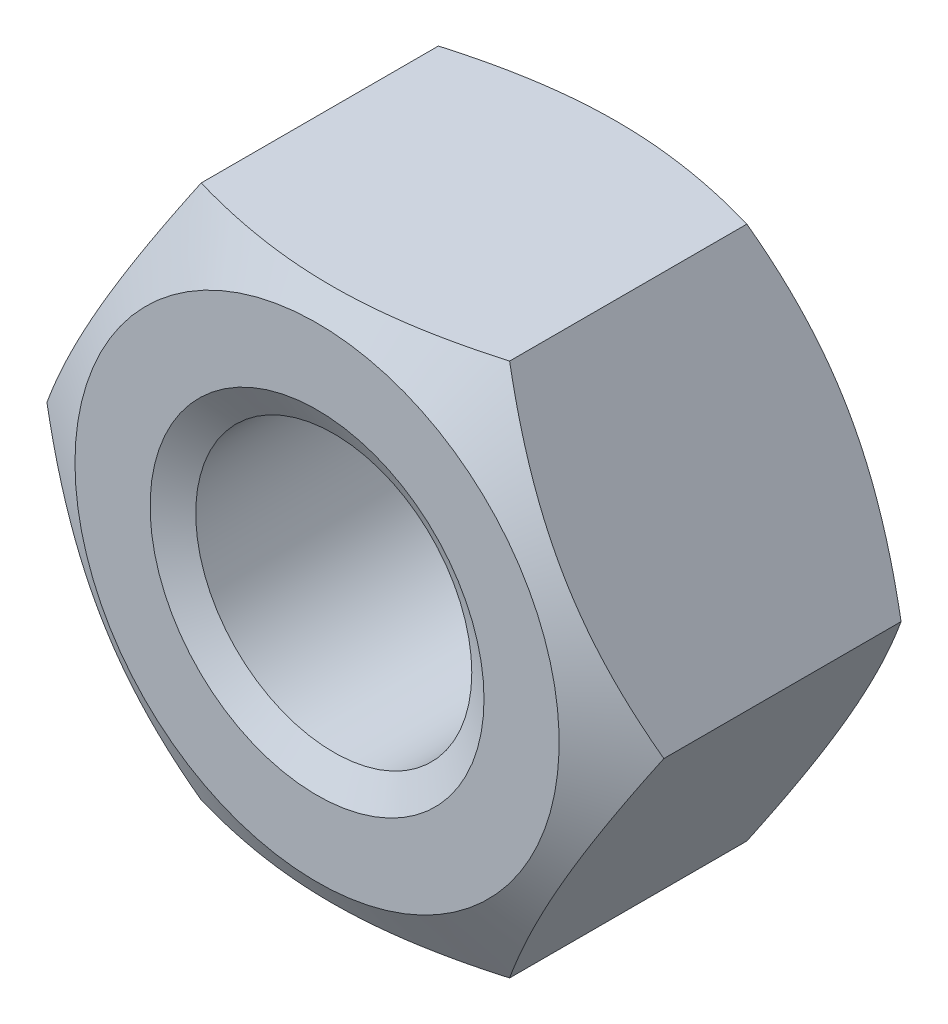
ISO-10303-21;
HEADER;
FILE_DESCRIPTION(('STEP AP214'),'2;1');
FILE_NAME('part.step','',(''),(''),'','','');
FILE_SCHEMA(('AUTOMOTIVE_DESIGN { 1 0 10303 214 1 1 1 1 }'));
ENDSEC;
DATA;
#1=APPLICATION_CONTEXT('core data for automotive mechanical design processes');
#2=APPLICATION_PROTOCOL_DEFINITION('international standard','automotive_design',2000,#1);
#3=PRODUCT_CONTEXT('',#1,'mechanical');
#4=PRODUCT('Part','Part','',(#3));
#5=PRODUCT_RELATED_PRODUCT_CATEGORY('part','',(#4));
#6=PRODUCT_DEFINITION_FORMATION('','',#4);
#7=PRODUCT_DEFINITION_CONTEXT('part definition',#1,'design');
#8=PRODUCT_DEFINITION('design','',#6,#7);
#9=PRODUCT_DEFINITION_SHAPE('','',#8);
#10=(LENGTH_UNIT() NAMED_UNIT(*) SI_UNIT(.MILLI.,.METRE.));
#11=(NAMED_UNIT(*) PLANE_ANGLE_UNIT() SI_UNIT($,.RADIAN.));
#12=(NAMED_UNIT(*) SI_UNIT($,.STERADIAN.) SOLID_ANGLE_UNIT());
#13=UNCERTAINTY_MEASURE_WITH_UNIT(LENGTH_MEASURE(1.E-05),#10,'distance_accuracy_value','');
#14=(GEOMETRIC_REPRESENTATION_CONTEXT(3) GLOBAL_UNCERTAINTY_ASSIGNED_CONTEXT((#13)) GLOBAL_UNIT_ASSIGNED_CONTEXT((#10,
#11,#12)) REPRESENTATION_CONTEXT('',''));
#15=CARTESIAN_POINT('',(0.,0.,0.));
#16=DIRECTION('',(0.,0.,1.));
#17=DIRECTION('',(1.,0.,0.));
#18=AXIS2_PLACEMENT_3D('',#15,#16,#17);
#19=CARTESIAN_POINT('',(2.3094010767585,-4.,-4.7));
#20=DIRECTION('',(0.866025403784439,-0.5,0.));
#21=DIRECTION('',(0.5,0.866025403784439,0.));
#22=AXIS2_PLACEMENT_3D('',#19,#20,#21);
#23=PLANE('',#22);
#24=CARTESIAN_POINT('',(2.30928560670467,-4.0002,-0.573838610020871));
#25=CARTESIAN_POINT('',(2.4107717464617,-3.82442084967677,-0.515224224594387));
#26=CARTESIAN_POINT('',(2.51313390883499,-3.64712438367362,-0.461916672408368));
#27=CARTESIAN_POINT('',(2.71963072479811,-3.28946140682429,-0.368868021692509));
#28=CARTESIAN_POINT('',(2.82376904741904,-3.10908854102985,-0.329159839975811));
#29=CARTESIAN_POINT('',(3.03075510011795,-2.75057818129721,-0.267348566226386));
#30=CARTESIAN_POINT('',(3.13357098372492,-2.57249584706486,-0.244834082468996));
#31=CARTESIAN_POINT('',(3.33968651028528,-2.21549328283349,-0.217956974092689));
#32=CARTESIAN_POINT('',(3.44298540411434,-2.0365743503559,-0.213572092373051));
#33=CARTESIAN_POINT('',(3.63600352522932,-1.70225715780327,-0.222696423886077));
#34=CARTESIAN_POINT('',(3.72575165335064,-1.54680884001294,-0.233965304934101));
#35=CARTESIAN_POINT('',(3.90466320392054,-1.23692494436495,-0.269680341744299));
#36=CARTESIAN_POINT('',(3.99382600759478,-1.08249043825587,-0.29413869665764));
#37=CARTESIAN_POINT('',(4.17310641015197,-0.771967672225423,-0.355282415865395));
#38=CARTESIAN_POINT('',(4.26320131938131,-0.615918711936898,-0.392226954600969));
#39=CARTESIAN_POINT('',(4.4420474282755,-0.306148164596161,-0.476076423494131));
#40=CARTESIAN_POINT('',(4.53080091904966,-0.152422609226221,-0.522961653158844));
#41=CARTESIAN_POINT('',(4.61891762357084,0.000199999999999867,-0.573838610020871));
#42=B_SPLINE_CURVE_WITH_KNOTS('',3,(#24,#25,#26,#27,#28,#29,#30,#31,#32,#33,#34,#35,#36,#37,#38,
#39,#40,#41),.UNSPECIFIED.,.F.,.F.,(4,2,2,2,2,2,2,2,4),(0.,0.634047835695965,1.26961969224543,
1.88946157213122,2.50854226669297,3.04757825393385,3.58711366126903,4.13861653143764,
4.68903648037743),.UNSPECIFIED.);
#43=CARTESIAN_POINT('',(2.30940107675851,-4.,-0.573771940854268));
#44=VERTEX_POINT('',#43);
#45=CARTESIAN_POINT('',(4.61880215351701,0.,-0.573771940854268));
#46=VERTEX_POINT('',#45);
#47=EDGE_CURVE('E50',#44,#46,#42,.T.);
#48=ORIENTED_EDGE('',*,*,#47,.F.);
#49=DIRECTION('',(0.,0.,1.));
#50=VECTOR('',#49,1.);
#51=CARTESIAN_POINT('',(2.3094010767585,-4.,-4.7));
#52=LINE('',#51,#50);
#53=CARTESIAN_POINT('',(2.30940107675851,-4.,-4.12622805914573));
#54=VERTEX_POINT('',#53);
#55=EDGE_CURVE('E114',#54,#44,#52,.T.);
#56=ORIENTED_EDGE('',*,*,#55,.F.);
#57=CARTESIAN_POINT('',(4.61891762357084,0.000200000000000424,-4.12616138997913));
#58=CARTESIAN_POINT('',(4.5174314838138,-0.175579150323227,-4.18477577540561));
#59=CARTESIAN_POINT('',(4.41506932144052,-0.35287561632638,-4.23808332759163));
#60=CARTESIAN_POINT('',(4.2085725054774,-0.710538593175705,-4.33113197830749));
#61=CARTESIAN_POINT('',(4.10443418285647,-0.89091145897015,-4.37084016002419));
#62=CARTESIAN_POINT('',(3.89744813015756,-1.24942181870279,-4.43265143377362));
#63=CARTESIAN_POINT('',(3.79463224655059,-1.42750415293514,-4.455165917531));
#64=CARTESIAN_POINT('',(3.58851671999023,-1.78450671716651,-4.48204302590731));
#65=CARTESIAN_POINT('',(3.48521782616117,-1.9634256496441,-4.48642790762695));
#66=CARTESIAN_POINT('',(3.29219970504619,-2.29774284219673,-4.47730357611392));
#67=CARTESIAN_POINT('',(3.20245157692486,-2.45319115998706,-4.4660346950659));
#68=CARTESIAN_POINT('',(3.02354002635497,-2.76307505563505,-4.4303196582557));
#69=CARTESIAN_POINT('',(2.93437722268073,-2.91750956174413,-4.40586130334236));
#70=CARTESIAN_POINT('',(2.75509682012354,-3.22803232777458,-4.34471758413461));
#71=CARTESIAN_POINT('',(2.6650019108942,-3.3840812880631,-4.30777304539903));
#72=CARTESIAN_POINT('',(2.48615580200001,-3.69385183540384,-4.22392357650587));
#73=CARTESIAN_POINT('',(2.39740231122585,-3.84757739077378,-4.17703834684116));
#74=CARTESIAN_POINT('',(2.30928560670467,-4.0002,-4.12616138997913));
#75=B_SPLINE_CURVE_WITH_KNOTS('',3,(#57,#58,#59,#60,#61,#62,#63,#64,#65,#66,#67,#68,#69,#70,#71,
#72,#73,#74),.UNSPECIFIED.,.F.,.F.,(4,2,2,2,2,2,2,2,4),(0.,0.634047835695965,1.26961969224543,
1.88946157213122,2.50854226669297,3.04757825393385,3.58711366126903,4.13861653143764,
4.68903648037743),.UNSPECIFIED.);
#76=CARTESIAN_POINT('',(4.61880215351701,0.,-4.12622805914573));
#77=VERTEX_POINT('',#76);
#78=EDGE_CURVE('E125',#77,#54,#75,.T.);
#79=ORIENTED_EDGE('',*,*,#78,.F.);
#80=DIRECTION('',(0.,0.,1.));
#81=VECTOR('',#80,1.);
#82=CARTESIAN_POINT('',(4.61880215351701,0.,-4.7));
#83=LINE('',#82,#81);
#84=EDGE_CURVE('E122',#77,#46,#83,.T.);
#85=ORIENTED_EDGE('',*,*,#84,.T.);
#86=EDGE_LOOP('',(#48,#56,#79,#85));
#87=FACE_BOUND('',#86,.T.);
#88=ADVANCED_FACE('F35',(#87),#23,.T.);
#89=CARTESIAN_POINT('',(-2.3094010767585,-4.,-4.7));
#90=DIRECTION('',(0.,-1.,0.));
#91=DIRECTION('',(1.,0.,0.));
#92=AXIS2_PLACEMENT_3D('',#89,#90,#91);
#93=PLANE('',#92);
#94=CARTESIAN_POINT('',(-6.09489331699833,-4.,-2.11613226173038));
#95=CARTESIAN_POINT('',(-5.91950199158532,-4.,-2.03149845459807));
#96=CARTESIAN_POINT('',(-5.7436925721675,-4.,-1.94771521780684));
#97=CARTESIAN_POINT('',(-5.39101133396244,-4.,-1.78233664211584));
#98=CARTESIAN_POINT('',(-5.21413933442482,-4.,-1.70074168913957));
#99=CARTESIAN_POINT('',(-4.85813636501619,-4.,-1.53979001519612));
#100=CARTESIAN_POINT('',(-4.67899824047163,-4.,-1.46044906154063));
#101=CARTESIAN_POINT('',(-4.31923849988964,-4.,-1.30521851480991));
#102=CARTESIAN_POINT('',(-4.13861696283161,-4.,-1.22932873937654));
#103=CARTESIAN_POINT('',(-3.77350114804517,-4.,-1.08107583925161));
#104=CARTESIAN_POINT('',(-3.58898622006285,-4.,-1.00876328993188));
#105=CARTESIAN_POINT('',(-3.21776937753349,-4.,-0.869876931083467));
#106=CARTESIAN_POINT('',(-3.03106722116187,-4.,-0.803303763046062));
#107=CARTESIAN_POINT('',(-2.65557248329156,-4.,-0.677706911421507));
#108=CARTESIAN_POINT('',(-2.46678541614049,-4.,-0.6186669118505));
#109=CARTESIAN_POINT('',(-2.08652902254336,-4.,-0.510073166125042));
#110=CARTESIAN_POINT('',(-1.89506057319283,-4.,-0.460516392300252));
#111=CARTESIAN_POINT('',(-1.50929874076738,-4.,-0.373311085934368));
#112=CARTESIAN_POINT('',(-1.3150042603301,-4.,-0.335667315782019));
#113=CARTESIAN_POINT('',(-0.924106700195844,-4.,-0.274847986643028));
#114=CARTESIAN_POINT('',(-0.727503612749948,-4.,-0.251672476233678));
#115=CARTESIAN_POINT('',(-0.334240681054093,-4.,-0.221840557573594));
#116=CARTESIAN_POINT('',(-0.137588730973181,-4.,-0.21508272035275));
#117=CARTESIAN_POINT('',(0.255527926530267,-4.,-0.218431875319228));
#118=CARTESIAN_POINT('',(0.451992668522464,-4.,-0.228534642277113));
#119=CARTESIAN_POINT('',(0.788354694260788,-4.,-0.259560117676578));
#120=CARTESIAN_POINT('',(0.928625472743277,-4.,-0.276641969877719));
#121=CARTESIAN_POINT('',(1.20806274563834,-4.,-0.318274124276917));
#122=CARTESIAN_POINT('',(1.34722906904318,-4.,-0.342825560736373));
#123=CARTESIAN_POINT('',(1.76329750447572,-4.,-0.426460434695633));
#124=CARTESIAN_POINT('',(2.038222841116,-4.,-0.495467674954611));
#125=CARTESIAN_POINT('',(2.44940900932118,-4.,-0.614199979526076));
#126=CARTESIAN_POINT('',(2.587823037779,-4.,-0.65688505084575));
#127=CARTESIAN_POINT('',(2.86331367400337,-4.,-0.746448608554551));
#128=CARTESIAN_POINT('',(3.00039016122187,-4.,-0.793327469113979));
#129=CARTESIAN_POINT('',(3.27252112795964,-4.,-0.890278730810599));
#130=CARTESIAN_POINT('',(3.40758266487531,-4.,-0.940331521681944));
#131=CARTESIAN_POINT('',(3.6765608261696,-4.,-1.04329523164742));
#132=CARTESIAN_POINT('',(3.81047782797977,-4.,-1.09620516282043));
#133=CARTESIAN_POINT('',(3.94391362276095,-4.,-1.15027525964932));
#134=B_SPLINE_CURVE_WITH_KNOTS('',3,(#94,#95,#96,#97,#98,#99,#100,#101,#102,#103,#104,#105,#106,
#107,#108,#109,#110,#111,#112,#113,#114,#115,#116,#117,#118,#119,#120,#121,#122,#123,#124,#125,
#126,#127,#128,#129,#130,#131,#132,#133),.UNSPECIFIED.,.F.,.F.,(4,2,2,2,2,2,2,2,2,2,2,2,2,2,2,2,
2,2,2,4),(0.,0.584238260270339,1.16857888753194,1.75631615786472,2.34402233634899,
2.93848518114124,3.53301438320072,4.12623321774329,4.71926234061146,5.31252823651338,
5.90579612429932,6.49538935484718,7.08483485684393,7.50854871041553,7.93232693736171,
8.78152355203656,9.21602908262365,9.65057341857472,10.0826543796044,10.514586883744),.UNSPECIFIED.);
#135=CARTESIAN_POINT('',(-2.3094010767585,-4.,-0.573771940854268));
#136=VERTEX_POINT('',#135);
#137=EDGE_CURVE('E107',#136,#44,#134,.T.);
#138=ORIENTED_EDGE('',*,*,#137,.F.);
#139=DIRECTION('',(0.,0.,1.));
#140=VECTOR('',#139,1.);
#141=CARTESIAN_POINT('',(-2.3094010767585,-4.,-4.7));
#142=LINE('',#141,#140);
#143=CARTESIAN_POINT('',(-2.3094010767585,-4.,-4.12622805914573));
#144=VERTEX_POINT('',#143);
#145=EDGE_CURVE('E106',#144,#136,#142,.T.);
#146=ORIENTED_EDGE('',*,*,#145,.F.);
#147=CARTESIAN_POINT('',(-6.09489331699833,-4.,-2.58386773826962));
#148=CARTESIAN_POINT('',(-5.91950199158532,-4.,-2.66850154540194));
#149=CARTESIAN_POINT('',(-5.7436925721675,-4.,-2.75228478219317));
#150=CARTESIAN_POINT('',(-5.39101133396244,-4.,-2.91766335788416));
#151=CARTESIAN_POINT('',(-5.21413933442482,-4.,-2.99925831086044));
#152=CARTESIAN_POINT('',(-4.85813636501619,-4.,-3.16020998480389));
#153=CARTESIAN_POINT('',(-4.67899824047163,-4.,-3.23955093845938));
#154=CARTESIAN_POINT('',(-4.31923849988964,-4.,-3.39478148519009));
#155=CARTESIAN_POINT('',(-4.13861696283161,-4.,-3.47067126062346));
#156=CARTESIAN_POINT('',(-3.77350114804517,-4.,-3.61892416074839));
#157=CARTESIAN_POINT('',(-3.58898622006285,-4.,-3.69123671006813));
#158=CARTESIAN_POINT('',(-3.21776937753349,-4.,-3.83012306891654));
#159=CARTESIAN_POINT('',(-3.03106722116187,-4.,-3.89669623695394));
#160=CARTESIAN_POINT('',(-2.65557248329156,-4.,-4.0222930885785));
#161=CARTESIAN_POINT('',(-2.4667854161405,-4.,-4.0813330881495));
#162=CARTESIAN_POINT('',(-2.08652902254336,-4.,-4.18992683387496));
#163=CARTESIAN_POINT('',(-1.89506057319283,-4.,-4.23948360769975));
#164=CARTESIAN_POINT('',(-1.50929874076738,-4.,-4.32668891406563));
#165=CARTESIAN_POINT('',(-1.3150042603301,-4.,-4.36433268421798));
#166=CARTESIAN_POINT('',(-0.924106700195844,-4.,-4.42515201335697));
#167=CARTESIAN_POINT('',(-0.727503612749948,-4.,-4.44832752376632));
#168=CARTESIAN_POINT('',(-0.334240681054093,-4.,-4.47815944242641));
#169=CARTESIAN_POINT('',(-0.137588730973182,-4.,-4.48491727964725));
#170=CARTESIAN_POINT('',(0.255527926530266,-4.,-4.48156812468077));
#171=CARTESIAN_POINT('',(0.451992668522462,-4.,-4.47146535772289));
#172=CARTESIAN_POINT('',(0.788354694260787,-4.,-4.44043988232342));
#173=CARTESIAN_POINT('',(0.928625472743277,-4.,-4.42335803012228));
#174=CARTESIAN_POINT('',(1.20806274563834,-4.,-4.38172587572308));
#175=CARTESIAN_POINT('',(1.34722906904319,-4.,-4.35717443926363));
#176=CARTESIAN_POINT('',(1.76329750447572,-4.,-4.27353956530437));
#177=CARTESIAN_POINT('',(2.038222841116,-4.,-4.20453232504539));
#178=CARTESIAN_POINT('',(2.44940900932119,-4.,-4.08580002047393));
#179=CARTESIAN_POINT('',(2.58782303777901,-4.,-4.04311494915425));
#180=CARTESIAN_POINT('',(2.86331367400337,-4.,-3.95355139144545));
#181=CARTESIAN_POINT('',(3.00039016122187,-4.,-3.90667253088602));
#182=CARTESIAN_POINT('',(3.27252112795964,-4.,-3.8097212691894));
#183=CARTESIAN_POINT('',(3.40758266487531,-4.,-3.75966847831806));
#184=CARTESIAN_POINT('',(3.67656082616961,-4.,-3.65670476835258));
#185=CARTESIAN_POINT('',(3.81047782797977,-4.,-3.60379483717957));
#186=CARTESIAN_POINT('',(3.94391362276096,-4.,-3.54972474035068));
#187=B_SPLINE_CURVE_WITH_KNOTS('',3,(#147,#148,#149,#150,#151,#152,#153,#154,#155,#156,#157,
#158,#159,#160,#161,#162,#163,#164,#165,#166,#167,#168,#169,#170,#171,#172,#173,#174,#175,#176,
#177,#178,#179,#180,#181,#182,#183,#184,#185,#186),.UNSPECIFIED.,.F.,.F.,(4,2,2,2,2,2,2,2,2,2,2,
2,2,2,2,2,2,2,2,4),(0.,0.584238260270337,1.16857888753193,1.75631615786472,2.34402233634899,
2.93848518114124,3.53301438320071,4.12623321774328,4.71926234061146,5.31252823651338,
5.90579612429932,6.49538935484717,7.08483485684392,7.50854871041552,7.9323269373617,
8.78152355203656,9.21602908262365,9.65057341857472,10.0826543796044,10.514586883744),.UNSPECIFIED.);
#188=EDGE_CURVE('E196',#54,#144,#187,.F.);
#189=ORIENTED_EDGE('',*,*,#188,.F.);
#190=ORIENTED_EDGE('',*,*,#55,.T.);
#191=EDGE_LOOP('',(#138,#146,#189,#190));
#192=FACE_BOUND('',#191,.T.);
#193=ADVANCED_FACE('F204',(#192),#93,.T.);
#194=CARTESIAN_POINT('',(-4.61880215351701,0.,-4.7));
#195=DIRECTION('',(-0.866025403784438,-0.5,0.));
#196=DIRECTION('',(0.5,-0.866025403784438,0.));
#197=AXIS2_PLACEMENT_3D('',#194,#195,#196);
#198=PLANE('',#197);
#199=CARTESIAN_POINT('',(-4.61891762357085,0.00019999999999926,-0.573838610020872));
#200=CARTESIAN_POINT('',(-4.51743148381381,-0.175579150323229,-0.515224224594388));
#201=CARTESIAN_POINT('',(-4.41506932144052,-0.352875616326381,-0.461916672408369));
#202=CARTESIAN_POINT('',(-4.2085725054774,-0.710538593175707,-0.368868021692511));
#203=CARTESIAN_POINT('',(-4.10443418285647,-0.890911458970151,-0.329159839975811));
#204=CARTESIAN_POINT('',(-3.89744813015756,-1.24942181870279,-0.267348566226387));
#205=CARTESIAN_POINT('',(-3.79463224655059,-1.42750415293514,-0.244834082468997));
#206=CARTESIAN_POINT('',(-3.58851671999023,-1.78450671716651,-0.21795697409269));
#207=CARTESIAN_POINT('',(-3.48521782616117,-1.9634256496441,-0.213572092373051));
#208=CARTESIAN_POINT('',(-3.29219970504619,-2.29774284219673,-0.222696423886078));
#209=CARTESIAN_POINT('',(-3.20245157692486,-2.45319115998707,-0.233965304934102));
#210=CARTESIAN_POINT('',(-3.02354002635497,-2.76307505563506,-0.2696803417443));
#211=CARTESIAN_POINT('',(-2.93437722268073,-2.91750956174413,-0.29413869665764));
#212=CARTESIAN_POINT('',(-2.75509682012354,-3.22803232777458,-0.355282415865395));
#213=CARTESIAN_POINT('',(-2.6650019108942,-3.3840812880631,-0.392226954600969));
#214=CARTESIAN_POINT('',(-2.48615580200001,-3.69385183540384,-0.476076423494132));
#215=CARTESIAN_POINT('',(-2.39740231122585,-3.84757739077378,-0.522961653158845));
#216=CARTESIAN_POINT('',(-2.30928560670467,-4.0002,-0.57383861002087));
#217=B_SPLINE_CURVE_WITH_KNOTS('',3,(#199,#200,#201,#202,#203,#204,#205,#206,#207,#208,#209,
#210,#211,#212,#213,#214,#215,#216),.UNSPECIFIED.,.F.,.F.,(4,2,2,2,2,2,2,2,4),(0.,
0.634047835695965,1.26961969224543,1.88946157213122,2.50854226669297,3.04757825393386,
3.58711366126903,4.13861653143764,4.68903648037743),.UNSPECIFIED.);
#218=CARTESIAN_POINT('',(-4.61880215351701,0.,-0.573771940854268));
#219=VERTEX_POINT('',#218);
#220=EDGE_CURVE('E90',#219,#136,#217,.T.);
#221=ORIENTED_EDGE('',*,*,#220,.F.);
#222=DIRECTION('',(0.,0.,1.));
#223=VECTOR('',#222,1.);
#224=CARTESIAN_POINT('',(-4.61880215351701,0.,-4.7));
#225=LINE('',#224,#223);
#226=CARTESIAN_POINT('',(-4.61880215351701,0.,-4.12622805914573));
#227=VERTEX_POINT('',#226);
#228=EDGE_CURVE('E104',#227,#219,#225,.T.);
#229=ORIENTED_EDGE('',*,*,#228,.F.);
#230=CARTESIAN_POINT('',(-2.30928560670467,-4.0002,-4.12616138997913));
#231=CARTESIAN_POINT('',(-2.41077174646171,-3.82442084967677,-4.18477577540561));
#232=CARTESIAN_POINT('',(-2.513133908835,-3.64712438367362,-4.23808332759163));
#233=CARTESIAN_POINT('',(-2.71963072479812,-3.28946140682429,-4.33113197830749));
#234=CARTESIAN_POINT('',(-2.82376904741904,-3.10908854102985,-4.37084016002419));
#235=CARTESIAN_POINT('',(-3.03075510011795,-2.75057818129721,-4.43265143377361));
#236=CARTESIAN_POINT('',(-3.13357098372492,-2.57249584706486,-4.455165917531));
#237=CARTESIAN_POINT('',(-3.33968651028528,-2.21549328283349,-4.48204302590731));
#238=CARTESIAN_POINT('',(-3.44298540411434,-2.0365743503559,-4.48642790762695));
#239=CARTESIAN_POINT('',(-3.63600352522932,-1.70225715780327,-4.47730357611392));
#240=CARTESIAN_POINT('',(-3.72575165335065,-1.54680884001294,-4.4660346950659));
#241=CARTESIAN_POINT('',(-3.90466320392054,-1.23692494436495,-4.4303196582557));
#242=CARTESIAN_POINT('',(-3.99382600759478,-1.08249043825587,-4.40586130334236));
#243=CARTESIAN_POINT('',(-4.17310641015197,-0.771967672225423,-4.3447175841346));
#244=CARTESIAN_POINT('',(-4.26320131938131,-0.615918711936899,-4.30777304539903));
#245=CARTESIAN_POINT('',(-4.4420474282755,-0.306148164596161,-4.22392357650587));
#246=CARTESIAN_POINT('',(-4.53080091904966,-0.152422609226222,-4.17703834684116));
#247=CARTESIAN_POINT('',(-4.61891762357085,0.000199999999999208,-4.12616138997913));
#248=B_SPLINE_CURVE_WITH_KNOTS('',3,(#230,#231,#232,#233,#234,#235,#236,#237,#238,#239,#240,
#241,#242,#243,#244,#245,#246,#247),.UNSPECIFIED.,.F.,.F.,(4,2,2,2,2,2,2,2,4),(0.,
0.634047835695966,1.26961969224543,1.88946157213122,2.50854226669297,3.04757825393385,
3.58711366126903,4.13861653143764,4.68903648037743),.UNSPECIFIED.);
#249=EDGE_CURVE('E190',#144,#227,#248,.T.);
#250=ORIENTED_EDGE('',*,*,#249,.F.);
#251=ORIENTED_EDGE('',*,*,#145,.T.);
#252=EDGE_LOOP('',(#221,#229,#250,#251));
#253=FACE_BOUND('',#252,.T.);
#254=ADVANCED_FACE('F102',(#253),#198,.T.);
#255=CARTESIAN_POINT('',(-2.3094010767585,4.,-4.7));
#256=DIRECTION('',(-0.866025403784439,0.5,0.));
#257=DIRECTION('',(-0.5,-0.866025403784439,0.));
#258=AXIS2_PLACEMENT_3D('',#255,#256,#257);
#259=PLANE('',#258);
#260=CARTESIAN_POINT('',(-2.30928560670467,4.0002,-0.573838610020871));
#261=CARTESIAN_POINT('',(-2.41077174646171,3.82442084967677,-0.515224224594387));
#262=CARTESIAN_POINT('',(-2.513133908835,3.64712438367362,-0.461916672408368));
#263=CARTESIAN_POINT('',(-2.71963072479812,3.28946140682429,-0.36886802169251));
#264=CARTESIAN_POINT('',(-2.82376904741904,3.10908854102985,-0.329159839975811));
#265=CARTESIAN_POINT('',(-3.03075510011795,2.75057818129721,-0.267348566226386));
#266=CARTESIAN_POINT('',(-3.13357098372492,2.57249584706486,-0.244834082468996));
#267=CARTESIAN_POINT('',(-3.33968651028528,2.21549328283349,-0.21795697409269));
#268=CARTESIAN_POINT('',(-3.44298540411434,2.0365743503559,-0.213572092373051));
#269=CARTESIAN_POINT('',(-3.63600352522932,1.70225715780327,-0.222696423886078));
#270=CARTESIAN_POINT('',(-3.72575165335065,1.54680884001294,-0.233965304934102));
#271=CARTESIAN_POINT('',(-3.90466320392054,1.23692494436495,-0.2696803417443));
#272=CARTESIAN_POINT('',(-3.99382600759478,1.08249043825587,-0.29413869665764));
#273=CARTESIAN_POINT('',(-4.17310641015197,0.771967672225423,-0.355282415865396));
#274=CARTESIAN_POINT('',(-4.26320131938131,0.615918711936898,-0.39222695460097));
#275=CARTESIAN_POINT('',(-4.4420474282755,0.306148164596161,-0.476076423494132));
#276=CARTESIAN_POINT('',(-4.53080091904966,0.152422609226221,-0.522961653158845));
#277=CARTESIAN_POINT('',(-4.61891762357085,-0.000200000000000498,-0.573838610020872));
#278=B_SPLINE_CURVE_WITH_KNOTS('',3,(#260,#261,#262,#263,#264,#265,#266,#267,#268,#269,#270,
#271,#272,#273,#274,#275,#276,#277),.UNSPECIFIED.,.F.,.F.,(4,2,2,2,2,2,2,2,4),(0.,
0.634047835695966,1.26961969224543,1.88946157213122,2.50854226669297,3.04757825393385,
3.58711366126903,4.13861653143764,4.68903648037743),.UNSPECIFIED.);
#279=CARTESIAN_POINT('',(-2.30940107675851,4.,-0.573771940854268));
#280=VERTEX_POINT('',#279);
#281=EDGE_CURVE('E86',#280,#219,#278,.T.);
#282=ORIENTED_EDGE('',*,*,#281,.F.);
#283=DIRECTION('',(0.,0.,1.));
#284=VECTOR('',#283,1.);
#285=CARTESIAN_POINT('',(-2.3094010767585,4.,-4.7));
#286=LINE('',#285,#284);
#287=CARTESIAN_POINT('',(-2.30940107675851,4.,-4.12622805914573));
#288=VERTEX_POINT('',#287);
#289=EDGE_CURVE('E112',#288,#280,#286,.T.);
#290=ORIENTED_EDGE('',*,*,#289,.F.);
#291=CARTESIAN_POINT('',(-4.61891762357085,-0.000200000000000778,-4.12616138997913));
#292=CARTESIAN_POINT('',(-4.51743148381381,0.175579150323227,-4.18477577540561));
#293=CARTESIAN_POINT('',(-4.41506932144052,0.35287561632638,-4.23808332759163));
#294=CARTESIAN_POINT('',(-4.2085725054774,0.710538593175705,-4.33113197830749));
#295=CARTESIAN_POINT('',(-4.10443418285647,0.890911458970149,-4.37084016002419));
#296=CARTESIAN_POINT('',(-3.89744813015756,1.24942181870279,-4.43265143377361));
#297=CARTESIAN_POINT('',(-3.7946322465506,1.42750415293514,-4.455165917531));
#298=CARTESIAN_POINT('',(-3.58851671999023,1.78450671716651,-4.48204302590731));
#299=CARTESIAN_POINT('',(-3.48521782616117,1.9634256496441,-4.48642790762695));
#300=CARTESIAN_POINT('',(-3.29219970504619,2.29774284219673,-4.47730357611392));
#301=CARTESIAN_POINT('',(-3.20245157692487,2.45319115998706,-4.4660346950659));
#302=CARTESIAN_POINT('',(-3.02354002635497,2.76307505563505,-4.4303196582557));
#303=CARTESIAN_POINT('',(-2.93437722268073,2.91750956174413,-4.40586130334236));
#304=CARTESIAN_POINT('',(-2.75509682012354,3.22803232777458,-4.34471758413461));
#305=CARTESIAN_POINT('',(-2.6650019108942,3.3840812880631,-4.30777304539903));
#306=CARTESIAN_POINT('',(-2.48615580200001,3.69385183540384,-4.22392357650587));
#307=CARTESIAN_POINT('',(-2.39740231122585,3.84757739077378,-4.17703834684116));
#308=CARTESIAN_POINT('',(-2.30928560670467,4.0002,-4.12616138997913));
#309=B_SPLINE_CURVE_WITH_KNOTS('',3,(#291,#292,#293,#294,#295,#296,#297,#298,#299,#300,#301,
#302,#303,#304,#305,#306,#307,#308),.UNSPECIFIED.,.F.,.F.,(4,2,2,2,2,2,2,2,4),(0.,
0.634047835695964,1.26961969224543,1.88946157213122,2.50854226669297,3.04757825393385,
3.58711366126903,4.13861653143764,4.68903648037743),.UNSPECIFIED.);
#310=EDGE_CURVE('E111',#227,#288,#309,.T.);
#311=ORIENTED_EDGE('',*,*,#310,.F.);
#312=ORIENTED_EDGE('',*,*,#228,.T.);
#313=EDGE_LOOP('',(#282,#290,#311,#312));
#314=FACE_BOUND('',#313,.T.);
#315=ADVANCED_FACE('F110',(#314),#259,.T.);
#316=CARTESIAN_POINT('',(2.3094010767585,4.,-4.7));
#317=DIRECTION('',(0.,1.,0.));
#318=DIRECTION('',(0.,0.,1.));
#319=AXIS2_PLACEMENT_3D('',#316,#317,#318);
#320=PLANE('',#319);
#321=CARTESIAN_POINT('',(-6.09489331698854,4.,-2.11613226172566));
#322=CARTESIAN_POINT('',(-5.91950199157587,4.,-2.03149845459354));
#323=CARTESIAN_POINT('',(-5.74369257215839,4.,-1.94771521780252));
#324=CARTESIAN_POINT('',(-5.39101133395399,4.,-1.78233664211192));
#325=CARTESIAN_POINT('',(-5.21413933441671,4.,-1.70074168913585));
#326=CARTESIAN_POINT('',(-4.85813636500876,4.,-1.53979001519281));
#327=CARTESIAN_POINT('',(-4.67899824046454,4.,-1.46044906153752));
#328=CARTESIAN_POINT('',(-4.31923849988323,4.,-1.3052185148072));
#329=CARTESIAN_POINT('',(-4.13861696282555,4.,-1.22932873937403));
#330=CARTESIAN_POINT('',(-3.7735011480398,4.,-1.08107583924949));
#331=CARTESIAN_POINT('',(-3.58898622005784,4.,-1.00876328992995));
#332=CARTESIAN_POINT('',(-3.21776937752919,4.,-0.869876931081914));
#333=CARTESIAN_POINT('',(-3.03106722115793,4.,-0.803303763044692));
#334=CARTESIAN_POINT('',(-2.65557248328835,4.,-0.677706911420485));
#335=CARTESIAN_POINT('',(-2.46678541613765,4.,-0.618666911849643));
#336=CARTESIAN_POINT('',(-2.08652902254126,4.,-0.510073166124486));
#337=CARTESIAN_POINT('',(-1.8950605731911,4.,-0.460516392299832));
#338=CARTESIAN_POINT('',(-1.50929874076661,4.,-0.373311085934224));
#339=CARTESIAN_POINT('',(-1.31500426032993,4.,-0.335667315782002));
#340=CARTESIAN_POINT('',(-0.924106700196857,4.,-0.274847986643176));
#341=CARTESIAN_POINT('',(-0.727503612751563,4.,-0.251672476233863));
#342=CARTESIAN_POINT('',(-0.334240681056909,4.,-0.221840557573747));
#343=CARTESIAN_POINT('',(-0.137588730976597,4.,-0.215082720352835));
#344=CARTESIAN_POINT('',(0.255527926525664,4.,-0.218431875319075));
#345=CARTESIAN_POINT('',(0.451992668517272,4.,-0.228534642276791));
#346=CARTESIAN_POINT('',(0.788354694254841,4.,-0.259560117675916));
#347=CARTESIAN_POINT('',(0.928625472737157,4.,-0.276641969876923));
#348=CARTESIAN_POINT('',(1.20806274563188,4.,-0.318274124275841));
#349=CARTESIAN_POINT('',(1.34722906903656,4.,-0.342825560735152));
#350=CARTESIAN_POINT('',(1.7632975044686,4.,-0.426460434693978));
#351=CARTESIAN_POINT('',(2.03822284110857,4.,-0.495467674952662));
#352=CARTESIAN_POINT('',(2.44940900931328,4.,-0.614199979523693));
#353=CARTESIAN_POINT('',(2.58782303777094,4.,-0.656885050843221));
#354=CARTESIAN_POINT('',(2.86331367399499,4.,-0.746448608551735));
#355=CARTESIAN_POINT('',(3.00039016121333,4.,-0.793327469111021));
#356=CARTESIAN_POINT('',(3.27252112795078,4.,-0.890278730807362));
#357=CARTESIAN_POINT('',(3.40758266486629,4.,-0.94033152167857));
#358=CARTESIAN_POINT('',(3.67656082616028,4.,-1.04329523164377));
#359=CARTESIAN_POINT('',(3.81047782797029,4.,-1.09620516281665));
#360=CARTESIAN_POINT('',(3.94391362275132,4.,-1.15027525964541));
#361=B_SPLINE_CURVE_WITH_KNOTS('',3,(#321,#322,#323,#324,#325,#326,#327,#328,#329,#330,#331,
#332,#333,#334,#335,#336,#337,#338,#339,#340,#341,#342,#343,#344,#345,#346,#347,#348,#349,#350,
#351,#352,#353,#354,#355,#356,#357,#358,#359,#360),.UNSPECIFIED.,.F.,.F.,(4,2,2,2,2,2,2,2,2,2,2,
2,2,2,2,2,2,2,2,4),(0.,0.58423826026917,1.1685788875296,1.7563161578612,2.34402233634429,
2.93848518113534,3.53301438319362,4.12623321773499,4.71926234060197,5.31252823650209,
5.90579612428623,6.4953893548323,7.08483485682727,7.5085487103983,7.93232693734391,
8.78152355201763,9.21602908260414,9.65057341855462,10.0826543795838,10.5145868837227),.UNSPECIFIED.);
#362=CARTESIAN_POINT('',(2.3094010767585,4.00000000000001,-0.573771940854268));
#363=VERTEX_POINT('',#362);
#364=EDGE_CURVE('E93',#363,#280,#361,.F.);
#365=ORIENTED_EDGE('',*,*,#364,.F.);
#366=DIRECTION('',(0.,0.,1.));
#367=VECTOR('',#366,1.);
#368=CARTESIAN_POINT('',(2.3094010767585,4.,-4.7));
#369=LINE('',#368,#367);
#370=CARTESIAN_POINT('',(2.3094010767585,4.,-4.12622805914574));
#371=VERTEX_POINT('',#370);
#372=EDGE_CURVE('E116',#371,#363,#369,.T.);
#373=ORIENTED_EDGE('',*,*,#372,.F.);
#374=CARTESIAN_POINT('',(-6.09489331698854,4.,-2.58386773827435));
#375=CARTESIAN_POINT('',(-5.91950199157587,4.,-2.66850154540646));
#376=CARTESIAN_POINT('',(-5.74369257215838,4.,-2.75228478219749));
#377=CARTESIAN_POINT('',(-5.39101133395399,4.,-2.91766335788808));
#378=CARTESIAN_POINT('',(-5.21413933441671,4.,-2.99925831086415));
#379=CARTESIAN_POINT('',(-4.85813636500876,4.,-3.1602099848072));
#380=CARTESIAN_POINT('',(-4.67899824046454,4.,-3.23955093846249));
#381=CARTESIAN_POINT('',(-4.31923849988323,4.,-3.3947814851928));
#382=CARTESIAN_POINT('',(-4.13861696282555,4.,-3.47067126062598));
#383=CARTESIAN_POINT('',(-3.7735011480398,4.,-3.61892416075051));
#384=CARTESIAN_POINT('',(-3.58898622005784,4.,-3.69123671007006));
#385=CARTESIAN_POINT('',(-3.21776937752919,4.,-3.83012306891809));
#386=CARTESIAN_POINT('',(-3.03106722115793,4.,-3.89669623695531));
#387=CARTESIAN_POINT('',(-2.65557248328835,4.,-4.02229308857952));
#388=CARTESIAN_POINT('',(-2.46678541613765,4.,-4.08133308815036));
#389=CARTESIAN_POINT('',(-2.08652902254126,4.,-4.18992683387552));
#390=CARTESIAN_POINT('',(-1.8950605731911,4.,-4.23948360770017));
#391=CARTESIAN_POINT('',(-1.50929874076661,4.,-4.32668891406578));
#392=CARTESIAN_POINT('',(-1.31500426032993,4.,-4.364332684218));
#393=CARTESIAN_POINT('',(-0.924106700196856,4.,-4.42515201335683));
#394=CARTESIAN_POINT('',(-0.727503612751563,4.,-4.44832752376614));
#395=CARTESIAN_POINT('',(-0.334240681056909,4.,-4.47815944242625));
#396=CARTESIAN_POINT('',(-0.137588730976597,4.,-4.48491727964717));
#397=CARTESIAN_POINT('',(0.255527926525664,4.,-4.48156812468093));
#398=CARTESIAN_POINT('',(0.451992668517271,4.,-4.47146535772321));
#399=CARTESIAN_POINT('',(0.788354694254841,4.,-4.44043988232408));
#400=CARTESIAN_POINT('',(0.928625472737157,4.,-4.42335803012308));
#401=CARTESIAN_POINT('',(1.20806274563188,4.,-4.38172587572416));
#402=CARTESIAN_POINT('',(1.34722906903656,4.,-4.35717443926485));
#403=CARTESIAN_POINT('',(1.76329750446861,4.,-4.27353956530602));
#404=CARTESIAN_POINT('',(2.03822284110857,4.,-4.20453232504734));
#405=CARTESIAN_POINT('',(2.44940900931329,4.,-4.08580002047631));
#406=CARTESIAN_POINT('',(2.58782303777095,4.,-4.04311494915678));
#407=CARTESIAN_POINT('',(2.863313673995,4.,-3.95355139144827));
#408=CARTESIAN_POINT('',(3.00039016121334,4.,-3.90667253088898));
#409=CARTESIAN_POINT('',(3.27252112795079,4.,-3.80972126919264));
#410=CARTESIAN_POINT('',(3.4075826648663,4.,-3.75966847832143));
#411=CARTESIAN_POINT('',(3.67656082616029,4.,-3.65670476835623));
#412=CARTESIAN_POINT('',(3.8104778279703,4.,-3.60379483718335));
#413=CARTESIAN_POINT('',(3.94391362275133,4.,-3.54972474035459));
#414=B_SPLINE_CURVE_WITH_KNOTS('',3,(#374,#375,#376,#377,#378,#379,#380,#381,#382,#383,#384,
#385,#386,#387,#388,#389,#390,#391,#392,#393,#394,#395,#396,#397,#398,#399,#400,#401,#402,#403,
#404,#405,#406,#407,#408,#409,#410,#411,#412,#413),.UNSPECIFIED.,.F.,.F.,(4,2,2,2,2,2,2,2,2,2,2,
2,2,2,2,2,2,2,2,4),(0.,0.584238260269169,1.1685788875296,1.7563161578612,2.34402233634429,
2.93848518113534,3.53301438319361,4.12623321773499,4.71926234060197,5.31252823650208,
5.90579612428622,6.4953893548323,7.08483485682726,7.5085487103983,7.93232693734391,
8.78152355201764,9.21602908260414,9.65057341855462,10.0826543795838,10.5145868837227),.UNSPECIFIED.);
#415=EDGE_CURVE('E58',#288,#371,#414,.T.);
#416=ORIENTED_EDGE('',*,*,#415,.F.);
#417=ORIENTED_EDGE('',*,*,#289,.T.);
#418=EDGE_LOOP('',(#365,#373,#416,#417));
#419=FACE_BOUND('',#418,.T.);
#420=ADVANCED_FACE('F227',(#419),#320,.T.);
#421=CARTESIAN_POINT('',(4.61880215351701,0.,-4.7));
#422=DIRECTION('',(0.866025403784438,0.5,0.));
#423=DIRECTION('',(-0.5,0.866025403784438,0.));
#424=AXIS2_PLACEMENT_3D('',#421,#422,#423);
#425=PLANE('',#424);
#426=CARTESIAN_POINT('',(4.61891762357084,-0.000199999999999615,-0.573838610020871));
#427=CARTESIAN_POINT('',(4.51743148381381,0.175579150323228,-0.515224224594387));
#428=CARTESIAN_POINT('',(4.41506932144052,0.352875616326381,-0.461916672408368));
#429=CARTESIAN_POINT('',(4.2085725054774,0.710538593175706,-0.368868021692509));
#430=CARTESIAN_POINT('',(4.10443418285647,0.89091145897015,-0.32915983997581));
#431=CARTESIAN_POINT('',(3.89744813015756,1.24942181870279,-0.267348566226386));
#432=CARTESIAN_POINT('',(3.79463224655059,1.42750415293514,-0.244834082468996));
#433=CARTESIAN_POINT('',(3.58851671999023,1.78450671716651,-0.217956974092689));
#434=CARTESIAN_POINT('',(3.48521782616117,1.9634256496441,-0.21357209237305));
#435=CARTESIAN_POINT('',(3.29219970504619,2.29774284219673,-0.222696423886077));
#436=CARTESIAN_POINT('',(3.20245157692486,2.45319115998706,-0.233965304934101));
#437=CARTESIAN_POINT('',(3.02354002635497,2.76307505563505,-0.269680341744299));
#438=CARTESIAN_POINT('',(2.93437722268072,2.91750956174413,-0.294138696657638));
#439=CARTESIAN_POINT('',(2.75509682012354,3.22803232777458,-0.355282415865394));
#440=CARTESIAN_POINT('',(2.6650019108942,3.3840812880631,-0.392226954600968));
#441=CARTESIAN_POINT('',(2.48615580200001,3.69385183540384,-0.476076423494131));
#442=CARTESIAN_POINT('',(2.39740231122585,3.84757739077378,-0.522961653158844));
#443=CARTESIAN_POINT('',(2.30928560670466,4.0002,-0.57383861002087));
#444=B_SPLINE_CURVE_WITH_KNOTS('',3,(#426,#427,#428,#429,#430,#431,#432,#433,#434,#435,#436,
#437,#438,#439,#440,#441,#442,#443),.UNSPECIFIED.,.F.,.F.,(4,2,2,2,2,2,2,2,4),(0.,
0.634047835695965,1.26961969224543,1.88946157213122,2.50854226669297,3.04757825393385,
3.58711366126903,4.13861653143764,4.68903648037743),.UNSPECIFIED.);
#445=EDGE_CURVE('E249',#46,#363,#444,.T.);
#446=ORIENTED_EDGE('',*,*,#445,.F.);
#447=ORIENTED_EDGE('',*,*,#84,.F.);
#448=CARTESIAN_POINT('',(2.30928560670466,4.0002,-4.12616138997913));
#449=CARTESIAN_POINT('',(2.4107717464617,3.82442084967677,-4.18477577540562));
#450=CARTESIAN_POINT('',(2.51313390883499,3.64712438367362,-4.23808332759163));
#451=CARTESIAN_POINT('',(2.71963072479811,3.28946140682429,-4.33113197830749));
#452=CARTESIAN_POINT('',(2.82376904741904,3.10908854102985,-4.37084016002419));
#453=CARTESIAN_POINT('',(3.03075510011795,2.75057818129721,-4.43265143377362));
#454=CARTESIAN_POINT('',(3.13357098372491,2.57249584706486,-4.45516591753101));
#455=CARTESIAN_POINT('',(3.33968651028528,2.21549328283349,-4.48204302590731));
#456=CARTESIAN_POINT('',(3.44298540411434,2.0365743503559,-4.48642790762695));
#457=CARTESIAN_POINT('',(3.63600352522932,1.70225715780327,-4.47730357611392));
#458=CARTESIAN_POINT('',(3.72575165335064,1.54680884001294,-4.4660346950659));
#459=CARTESIAN_POINT('',(3.90466320392054,1.23692494436495,-4.4303196582557));
#460=CARTESIAN_POINT('',(3.99382600759478,1.08249043825587,-4.40586130334236));
#461=CARTESIAN_POINT('',(4.17310641015197,0.771967672225423,-4.34471758413461));
#462=CARTESIAN_POINT('',(4.26320131938131,0.615918711936899,-4.30777304539903));
#463=CARTESIAN_POINT('',(4.4420474282755,0.306148164596161,-4.22392357650587));
#464=CARTESIAN_POINT('',(4.53080091904966,0.152422609226221,-4.17703834684116));
#465=CARTESIAN_POINT('',(4.61891762357084,-0.000199999999999655,-4.12616138997913));
#466=B_SPLINE_CURVE_WITH_KNOTS('',3,(#448,#449,#450,#451,#452,#453,#454,#455,#456,#457,#458,
#459,#460,#461,#462,#463,#464,#465),.UNSPECIFIED.,.F.,.F.,(4,2,2,2,2,2,2,2,4),(0.,
0.634047835695964,1.26961969224543,1.88946157213122,2.50854226669297,3.04757825393385,
3.58711366126903,4.13861653143764,4.68903648037743),.UNSPECIFIED.);
#467=EDGE_CURVE('E152',#371,#77,#466,.T.);
#468=ORIENTED_EDGE('',*,*,#467,.F.);
#469=ORIENTED_EDGE('',*,*,#372,.T.);
#470=EDGE_LOOP('',(#446,#447,#468,#469));
#471=FACE_BOUND('',#470,.T.);
#472=ADVANCED_FACE('F146',(#471),#425,.T.);
#473=CARTESIAN_POINT('',(4.61880215351701,0.,-4.7));
#474=DIRECTION('',(0.,0.,1.));
#475=DIRECTION('',(1.,0.,0.));
#476=AXIS2_PLACEMENT_3D('',#473,#474,#475);
#477=PLANE('',#476);
#478=CARTESIAN_POINT('',(0.,0.,-4.7));
#479=DIRECTION('',(0.,0.,1.));
#480=DIRECTION('',(1.,0.,0.));
#481=AXIS2_PLACEMENT_3D('',#478,#479,#480);
#482=CIRCLE('',#481,2.31699266655911);
#483=CARTESIAN_POINT('',(2.31699266655911,0.,-4.7));
#484=VERTEX_POINT('',#483);
#485=EDGE_CURVE('E126',#484,#484,#482,.T.);
#486=ORIENTED_EDGE('',*,*,#485,.T.);
#487=EDGE_LOOP('',(#486));
#488=FACE_BOUND('',#487,.T.);
#489=CARTESIAN_POINT('',(0.,0.,-4.7));
#490=DIRECTION('',(0.,0.,-1.));
#491=DIRECTION('',(-1.,0.,0.));
#492=AXIS2_PLACEMENT_3D('',#489,#490,#491);
#493=CIRCLE('',#492,3.625);
#494=CARTESIAN_POINT('',(-3.625,0.,-4.7));
#495=VERTEX_POINT('',#494);
#496=EDGE_CURVE('E150',#495,#495,#493,.T.);
#497=ORIENTED_EDGE('',*,*,#496,.T.);
#498=EDGE_LOOP('',(#497));
#499=FACE_BOUND('',#498,.T.);
#500=ADVANCED_FACE('F142',(#488,#499),#477,.F.);
#501=CARTESIAN_POINT('',(4.61880215351701,0.,0.));
#502=DIRECTION('',(0.,0.,1.));
#503=DIRECTION('',(1.,0.,0.));
#504=AXIS2_PLACEMENT_3D('',#501,#502,#503);
#505=PLANE('',#504);
#506=CARTESIAN_POINT('',(0.,0.,0.));
#507=DIRECTION('',(0.,0.,1.));
#508=DIRECTION('',(1.,0.,0.));
#509=AXIS2_PLACEMENT_3D('',#506,#507,#508);
#510=CIRCLE('',#509,2.5);
#511=CARTESIAN_POINT('',(2.5,0.,0.));
#512=VERTEX_POINT('',#511);
#513=EDGE_CURVE('E11',#512,#512,#510,.F.);
#514=ORIENTED_EDGE('',*,*,#513,.T.);
#515=EDGE_LOOP('',(#514));
#516=FACE_BOUND('',#515,.T.);
#517=CARTESIAN_POINT('',(0.,0.,0.));
#518=DIRECTION('',(0.,0.,-1.));
#519=DIRECTION('',(-1.,0.,0.));
#520=AXIS2_PLACEMENT_3D('',#517,#518,#519);
#521=CIRCLE('',#520,3.625);
#522=CARTESIAN_POINT('',(-3.625,0.,0.));
#523=VERTEX_POINT('',#522);
#524=EDGE_CURVE('E250',#523,#523,#521,.T.);
#525=ORIENTED_EDGE('',*,*,#524,.F.);
#526=EDGE_LOOP('',(#525));
#527=FACE_BOUND('',#526,.T.);
#528=ADVANCED_FACE('F145',(#516,#527),#505,.T.);
#529=CARTESIAN_POINT('',(0.,0.,-4.7));
#530=DIRECTION('',(0.,0.,1.));
#531=DIRECTION('',(1.,0.,0.));
#532=AXIS2_PLACEMENT_3D('',#529,#530,#531);
#533=CYLINDRICAL_SURFACE('',#532,2.067);
#534=CARTESIAN_POINT('',(0.,0.,-4.267));
#535=DIRECTION('',(0.,0.,1.));
#536=DIRECTION('',(1.,0.,0.));
#537=AXIS2_PLACEMENT_3D('',#534,#535,#536);
#538=CIRCLE('',#537,2.067);
#539=CARTESIAN_POINT('',(2.067,0.,-4.267));
#540=VERTEX_POINT('',#539);
#541=EDGE_CURVE('E43',#540,#540,#538,.F.);
#542=ORIENTED_EDGE('',*,*,#541,.T.);
#543=EDGE_LOOP('',(#542));
#544=FACE_BOUND('',#543,.T.);
#545=CARTESIAN_POINT('',(0.,0.,-0.249992666559108));
#546=DIRECTION('',(0.,0.,1.));
#547=DIRECTION('',(1.,0.,0.));
#548=AXIS2_PLACEMENT_3D('',#545,#546,#547);
#549=CIRCLE('',#548,2.067);
#550=CARTESIAN_POINT('',(2.067,0.,-0.249992666559108));
#551=VERTEX_POINT('',#550);
#552=EDGE_CURVE('E129',#551,#551,#549,.T.);
#553=ORIENTED_EDGE('',*,*,#552,.T.);
#554=EDGE_LOOP('',(#553));
#555=FACE_BOUND('',#554,.T.);
#556=ADVANCED_FACE('F134',(#544,#555),#533,.F.);
#557=CARTESIAN_POINT('',(0.,0.,-4.12622805914573));
#558=DIRECTION('',(0.,0.,1.));
#559=DIRECTION('',(1.,0.,0.));
#560=AXIS2_PLACEMENT_3D('',#557,#558,#559);
#561=CONICAL_SURFACE('',#560,4.61880215351701,1.0471975511966);
#562=ORIENTED_EDGE('',*,*,#78,.T.);
#563=ORIENTED_EDGE('',*,*,#188,.T.);
#564=ORIENTED_EDGE('',*,*,#249,.T.);
#565=ORIENTED_EDGE('',*,*,#310,.T.);
#566=ORIENTED_EDGE('',*,*,#415,.T.);
#567=ORIENTED_EDGE('',*,*,#467,.T.);
#568=EDGE_LOOP('',(#562,#563,#564,#565,#566,#567));
#569=FACE_BOUND('',#568,.T.);
#570=ORIENTED_EDGE('',*,*,#496,.F.);
#571=EDGE_LOOP('',(#570));
#572=FACE_BOUND('',#571,.T.);
#573=ADVANCED_FACE('F174',(#569,#572),#561,.T.);
#574=CARTESIAN_POINT('',(0.,0.,0.));
#575=DIRECTION('',(0.,0.,-1.));
#576=DIRECTION('',(-1.,0.,0.));
#577=AXIS2_PLACEMENT_3D('',#574,#575,#576);
#578=CONICAL_SURFACE('',#577,3.625,1.0471975511966);
#579=ORIENTED_EDGE('',*,*,#47,.T.);
#580=ORIENTED_EDGE('',*,*,#445,.T.);
#581=ORIENTED_EDGE('',*,*,#364,.T.);
#582=ORIENTED_EDGE('',*,*,#281,.T.);
#583=ORIENTED_EDGE('',*,*,#220,.T.);
#584=ORIENTED_EDGE('',*,*,#137,.T.);
#585=EDGE_LOOP('',(#579,#580,#581,#582,#583,#584));
#586=FACE_BOUND('',#585,.T.);
#587=ORIENTED_EDGE('',*,*,#524,.T.);
#588=EDGE_LOOP('',(#587));
#589=FACE_BOUND('',#588,.T.);
#590=ADVANCED_FACE('F88',(#586,#589),#578,.T.);
#591=CARTESIAN_POINT('',(0.,0.,-4.7));
#592=DIRECTION('',(0.,0.,-1.));
#593=DIRECTION('',(-1.,0.,0.));
#594=AXIS2_PLACEMENT_3D('',#591,#592,#593);
#595=CONICAL_SURFACE('',#594,2.31699266655911,0.523598775598298);
#596=ORIENTED_EDGE('',*,*,#541,.F.);
#597=EDGE_LOOP('',(#596));
#598=FACE_BOUND('',#597,.T.);
#599=ORIENTED_EDGE('',*,*,#485,.F.);
#600=EDGE_LOOP('',(#599));
#601=FACE_BOUND('',#600,.T.);
#602=ADVANCED_FACE('F137',(#598,#601),#595,.F.);
#603=CARTESIAN_POINT('',(0.,0.,-0.249992666559108));
#604=DIRECTION('',(0.,0.,1.));
#605=DIRECTION('',(1.,0.,0.));
#606=AXIS2_PLACEMENT_3D('',#603,#604,#605);
#607=CONICAL_SURFACE('',#606,2.067,1.0471975511966);
#608=ORIENTED_EDGE('',*,*,#513,.F.);
#609=EDGE_LOOP('',(#608));
#610=FACE_BOUND('',#609,.T.);
#611=ORIENTED_EDGE('',*,*,#552,.F.);
#612=EDGE_LOOP('',(#611));
#613=FACE_BOUND('',#612,.T.);
#614=ADVANCED_FACE('F37',(#610,#613),#607,.F.);
#615=CLOSED_SHELL('',(#88,#193,#254,#315,#420,#472,#500,#528,#556,#573,#590,#602,#614));
#616=MANIFOLD_SOLID_BREP('B2',#615);
#617=ADVANCED_BREP_SHAPE_REPRESENTATION('',(#18,#616),#14);
#618=SHAPE_DEFINITION_REPRESENTATION(#9,#617);
ENDSEC;
END-ISO-10303-21;
